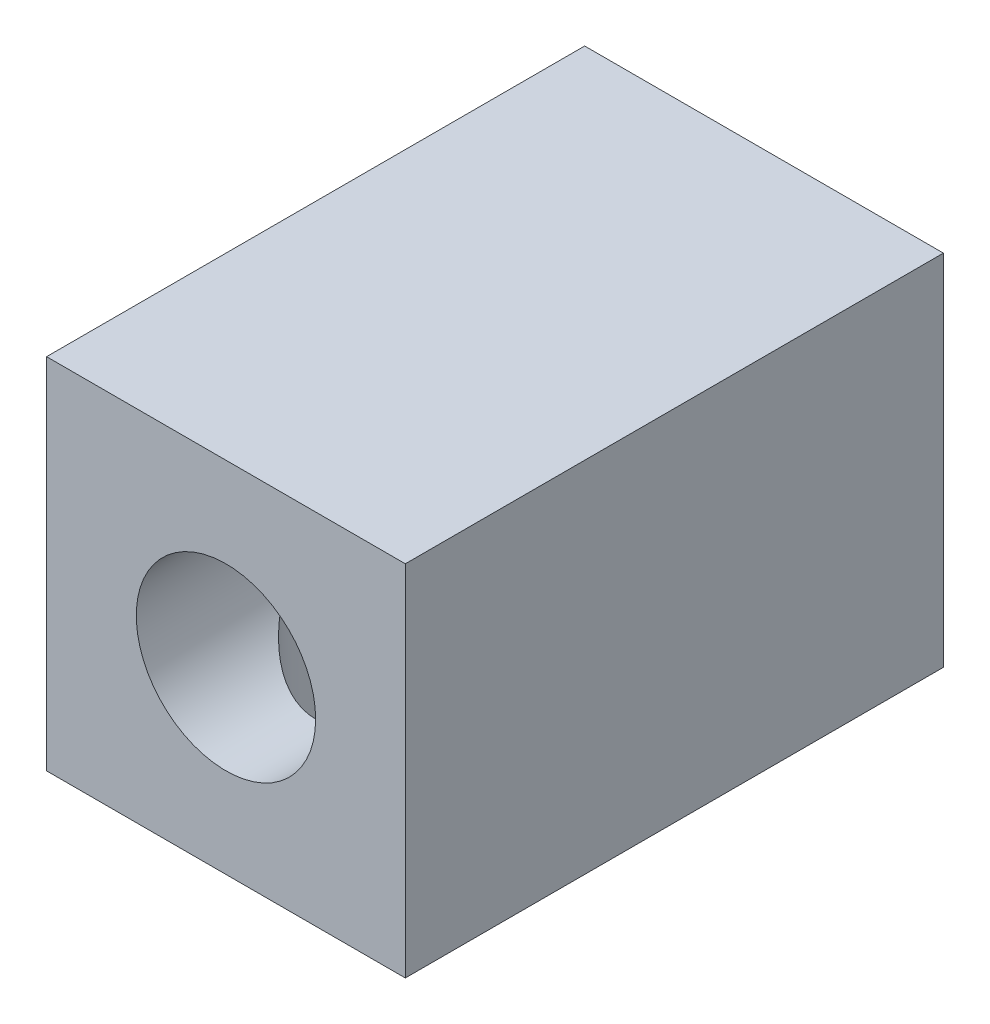
ISO-10303-21;
HEADER;
FILE_DESCRIPTION(('STEP AP214'),'2;1');
FILE_NAME('part.step','',(''),(''),'','','');
FILE_SCHEMA(('AUTOMOTIVE_DESIGN { 1 0 10303 214 1 1 1 1 }'));
ENDSEC;
DATA;
#1=APPLICATION_CONTEXT('core data for automotive mechanical design processes');
#2=APPLICATION_PROTOCOL_DEFINITION('international standard','automotive_design',2000,#1);
#3=PRODUCT_CONTEXT('',#1,'mechanical');
#4=PRODUCT('Part','Part','',(#3));
#5=PRODUCT_RELATED_PRODUCT_CATEGORY('part','',(#4));
#6=PRODUCT_DEFINITION_FORMATION('','',#4);
#7=PRODUCT_DEFINITION_CONTEXT('part definition',#1,'design');
#8=PRODUCT_DEFINITION('design','',#6,#7);
#9=PRODUCT_DEFINITION_SHAPE('','',#8);
#10=(LENGTH_UNIT() NAMED_UNIT(*) SI_UNIT(.MILLI.,.METRE.));
#11=(NAMED_UNIT(*) PLANE_ANGLE_UNIT() SI_UNIT($,.RADIAN.));
#12=(NAMED_UNIT(*) SI_UNIT($,.STERADIAN.) SOLID_ANGLE_UNIT());
#13=UNCERTAINTY_MEASURE_WITH_UNIT(LENGTH_MEASURE(1.E-05),#10,'distance_accuracy_value','');
#14=(GEOMETRIC_REPRESENTATION_CONTEXT(3) GLOBAL_UNCERTAINTY_ASSIGNED_CONTEXT((#13)) GLOBAL_UNIT_ASSIGNED_CONTEXT((#10,
#11,#12)) REPRESENTATION_CONTEXT('',''));
#15=CARTESIAN_POINT('',(0.,0.,0.));
#16=DIRECTION('',(0.,0.,1.));
#17=DIRECTION('',(1.,0.,0.));
#18=AXIS2_PLACEMENT_3D('',#15,#16,#17);
#19=CARTESIAN_POINT('',(-4.99999999999978,-5.00000000000061,14.9999999999998));
#20=DIRECTION('',(0.,0.,-1.));
#21=DIRECTION('',(-0.999999999999998,0.,0.));
#22=AXIS2_PLACEMENT_3D('',#19,#20,#21);
#23=PLANE('',#22);
#24=DIRECTION('',(0.,-0.999999999999998,0.));
#25=VECTOR('',#24,1.);
#26=CARTESIAN_POINT('',(-4.99999999999978,-5.00000000000061,14.9999999999998));
#27=LINE('',#26,#25);
#28=CARTESIAN_POINT('',(-4.99999999999884,4.99999999999967,14.9999999999999));
#29=VERTEX_POINT('',#28);
#30=CARTESIAN_POINT('',(-4.99999999999978,-5.00000000000061,14.9999999999998));
#31=VERTEX_POINT('',#30);
#32=EDGE_CURVE('E91',#29,#31,#27,.T.);
#33=ORIENTED_EDGE('',*,*,#32,.T.);
#34=DIRECTION('',(0.999999999999998,0.,0.));
#35=VECTOR('',#34,1.);
#36=CARTESIAN_POINT('',(-4.99999999999978,-5.00000000000061,14.9999999999998));
#37=LINE('',#36,#35);
#38=CARTESIAN_POINT('',(5.00000000000142,-5.00000000000012,15.0000000000001));
#39=VERTEX_POINT('',#38);
#40=EDGE_CURVE('E93',#31,#39,#37,.T.);
#41=ORIENTED_EDGE('',*,*,#40,.T.);
#42=DIRECTION('',(0.,0.999999999999998,0.));
#43=VECTOR('',#42,1.);
#44=CARTESIAN_POINT('',(5.00000000000142,-5.00000000000012,15.0000000000001));
#45=LINE('',#44,#43);
#46=CARTESIAN_POINT('',(5.00000000000031,5.00000000000006,14.9999999999981));
#47=VERTEX_POINT('',#46);
#48=EDGE_CURVE('E95',#39,#47,#45,.T.);
#49=ORIENTED_EDGE('',*,*,#48,.T.);
#50=DIRECTION('',(-0.999999999999998,0.,0.));
#51=VECTOR('',#50,1.);
#52=CARTESIAN_POINT('',(-4.99999999999884,4.99999999999967,14.9999999999999));
#53=LINE('',#52,#51);
#54=EDGE_CURVE('E36',#47,#29,#53,.T.);
#55=ORIENTED_EDGE('',*,*,#54,.T.);
#56=EDGE_LOOP('',(#33,#41,#49,#55));
#57=FACE_BOUND('',#56,.T.);
#58=CARTESIAN_POINT('',(9.43689570931383E-13,0.,14.9999999999995));
#59=DIRECTION('',(0.,0.,1.));
#60=DIRECTION('',(0.999999999999998,0.,0.));
#61=AXIS2_PLACEMENT_3D('',#58,#59,#60);
#62=CIRCLE('',#61,2.5);
#63=CARTESIAN_POINT('',(2.50000000000094,0.,14.9999999999996));
#64=VERTEX_POINT('',#63);
#65=EDGE_CURVE('E71',#64,#64,#62,.T.);
#66=ORIENTED_EDGE('',*,*,#65,.F.);
#67=EDGE_LOOP('',(#66));
#68=FACE_BOUND('',#67,.T.);
#69=ADVANCED_FACE('F16',(#57,#68),#23,.F.);
#70=CARTESIAN_POINT('',(-4.99999999999823,-5.00000000000023,-4.71844785465692E-13));
#71=DIRECTION('',(0.,0.,-1.));
#72=DIRECTION('',(-0.999999999999998,0.,0.));
#73=AXIS2_PLACEMENT_3D('',#70,#71,#72);
#74=PLANE('',#73);
#75=DIRECTION('',(0.,-0.999999999999998,0.));
#76=VECTOR('',#75,1.);
#77=CARTESIAN_POINT('',(-4.99999999999823,-5.00000000000023,-4.71844785465692E-13));
#78=LINE('',#77,#76);
#79=CARTESIAN_POINT('',(-4.99999999999917,4.99999999999995,-8.60422844084496E-13));
#80=VERTEX_POINT('',#79);
#81=CARTESIAN_POINT('',(-4.99999999999823,-5.00000000000023,-4.71844785465692E-13));
#82=VERTEX_POINT('',#81);
#83=EDGE_CURVE('E78',#80,#82,#78,.T.);
#84=ORIENTED_EDGE('',*,*,#83,.F.);
#85=DIRECTION('',(-0.999999999999998,0.,0.));
#86=VECTOR('',#85,1.);
#87=CARTESIAN_POINT('',(-4.99999999999917,4.99999999999995,-8.60422844084496E-13));
#88=LINE('',#87,#86);
#89=CARTESIAN_POINT('',(4.99999999999998,5.,0.));
#90=VERTEX_POINT('',#89);
#91=EDGE_CURVE('E89',#90,#80,#88,.T.);
#92=ORIENTED_EDGE('',*,*,#91,.F.);
#93=DIRECTION('',(0.,0.999999999999998,0.));
#94=VECTOR('',#93,1.);
#95=CARTESIAN_POINT('',(5.00000000000136,-4.99999999999967,-8.32667268468867E-13));
#96=LINE('',#95,#94);
#97=CARTESIAN_POINT('',(5.00000000000136,-4.99999999999967,-8.32667268468867E-13));
#98=VERTEX_POINT('',#97);
#99=EDGE_CURVE('E87',#98,#90,#96,.T.);
#100=ORIENTED_EDGE('',*,*,#99,.F.);
#101=DIRECTION('',(0.999999999999998,0.,0.));
#102=VECTOR('',#101,1.);
#103=CARTESIAN_POINT('',(-4.99999999999823,-5.00000000000023,-4.71844785465692E-13));
#104=LINE('',#103,#102);
#105=EDGE_CURVE('E85',#82,#98,#104,.T.);
#106=ORIENTED_EDGE('',*,*,#105,.F.);
#107=EDGE_LOOP('',(#84,#92,#100,#106));
#108=FACE_BOUND('',#107,.T.);
#109=CARTESIAN_POINT('',(7.49400541621981E-13,2.77555756156289E-13,-2.77555756156289E-13));
#110=DIRECTION('',(0.,0.,1.));
#111=DIRECTION('',(0.999999999999998,0.,0.));
#112=AXIS2_PLACEMENT_3D('',#109,#110,#111);
#113=CIRCLE('',#112,2.5);
#114=CARTESIAN_POINT('',(2.50000000000075,2.88059506803329E-13,-2.34187669256869E-13));
#115=VERTEX_POINT('',#114);
#116=EDGE_CURVE('E74',#115,#115,#113,.T.);
#117=ORIENTED_EDGE('',*,*,#116,.T.);
#118=EDGE_LOOP('',(#117));
#119=FACE_BOUND('',#118,.T.);
#120=ADVANCED_FACE('F117',(#108,#119),#74,.T.);
#121=CARTESIAN_POINT('',(-4.99999999999978,-5.00000000000061,14.9999999999998));
#122=DIRECTION('',(0.999999999999998,0.,0.));
#123=DIRECTION('',(0.,0.,-1.));
#124=AXIS2_PLACEMENT_3D('',#121,#122,#123);
#125=PLANE('',#124);
#126=ORIENTED_EDGE('',*,*,#83,.T.);
#127=DIRECTION('',(0.,0.,-1.));
#128=VECTOR('',#127,1.);
#129=CARTESIAN_POINT('',(-4.99999999999978,-5.00000000000061,14.9999999999998));
#130=LINE('',#129,#128);
#131=EDGE_CURVE('E62',#31,#82,#130,.T.);
#132=ORIENTED_EDGE('',*,*,#131,.F.);
#133=ORIENTED_EDGE('',*,*,#32,.F.);
#134=DIRECTION('',(0.,0.,-1.));
#135=VECTOR('',#134,1.);
#136=CARTESIAN_POINT('',(-4.99999999999884,4.99999999999967,14.9999999999999));
#137=LINE('',#136,#135);
#138=EDGE_CURVE('E98',#29,#80,#137,.T.);
#139=ORIENTED_EDGE('',*,*,#138,.T.);
#140=EDGE_LOOP('',(#126,#132,#133,#139));
#141=FACE_BOUND('',#140,.T.);
#142=ADVANCED_FACE('F18',(#141),#125,.F.);
#143=CARTESIAN_POINT('',(-4.99999999999978,-5.00000000000061,14.9999999999998));
#144=DIRECTION('',(0.,0.999999999999998,0.));
#145=DIRECTION('',(0.,0.,1.));
#146=AXIS2_PLACEMENT_3D('',#143,#144,#145);
#147=PLANE('',#146);
#148=CARTESIAN_POINT('',(1.52655665885959E-12,-5.00000000000012,9.99999999999979));
#149=DIRECTION('',(0.,0.999999999999998,0.));
#150=DIRECTION('',(0.,0.,1.));
#151=AXIS2_PLACEMENT_3D('',#148,#149,#150);
#152=CIRCLE('',#151,2.5);
#153=CARTESIAN_POINT('',(1.57492074936982E-12,-5.00000000000011,12.4999999999998));
#154=VERTEX_POINT('',#153);
#155=EDGE_CURVE('E76',#154,#154,#152,.T.);
#156=ORIENTED_EDGE('',*,*,#155,.T.);
#157=EDGE_LOOP('',(#156));
#158=FACE_BOUND('',#157,.T.);
#159=ORIENTED_EDGE('',*,*,#105,.T.);
#160=DIRECTION('',(0.,0.,-1.));
#161=VECTOR('',#160,1.);
#162=CARTESIAN_POINT('',(5.00000000000142,-5.00000000000012,15.0000000000001));
#163=LINE('',#162,#161);
#164=EDGE_CURVE('E104',#39,#98,#163,.T.);
#165=ORIENTED_EDGE('',*,*,#164,.F.);
#166=ORIENTED_EDGE('',*,*,#40,.F.);
#167=ORIENTED_EDGE('',*,*,#131,.T.);
#168=EDGE_LOOP('',(#159,#165,#166,#167));
#169=FACE_BOUND('',#168,.T.);
#170=ADVANCED_FACE('F110',(#158,#169),#147,.F.);
#171=CARTESIAN_POINT('',(5.00000000000142,-5.00000000000012,15.0000000000001));
#172=DIRECTION('',(-0.999999999999998,0.,0.));
#173=DIRECTION('',(0.,0.,1.));
#174=AXIS2_PLACEMENT_3D('',#171,#172,#173);
#175=PLANE('',#174);
#176=ORIENTED_EDGE('',*,*,#99,.T.);
#177=DIRECTION('',(0.,0.,-1.));
#178=VECTOR('',#177,1.);
#179=CARTESIAN_POINT('',(5.00000000000031,5.00000000000006,14.9999999999981));
#180=LINE('',#179,#178);
#181=EDGE_CURVE('E101',#47,#90,#180,.T.);
#182=ORIENTED_EDGE('',*,*,#181,.F.);
#183=ORIENTED_EDGE('',*,*,#48,.F.);
#184=ORIENTED_EDGE('',*,*,#164,.T.);
#185=EDGE_LOOP('',(#176,#182,#183,#184));
#186=FACE_BOUND('',#185,.T.);
#187=ADVANCED_FACE('F121',(#186),#175,.F.);
#188=CARTESIAN_POINT('',(-4.99999999999884,4.99999999999967,14.9999999999999));
#189=DIRECTION('',(0.,-0.999999999999998,0.));
#190=DIRECTION('',(0.999999999999998,0.,0.));
#191=AXIS2_PLACEMENT_3D('',#188,#189,#190);
#192=PLANE('',#191);
#193=ORIENTED_EDGE('',*,*,#91,.T.);
#194=ORIENTED_EDGE('',*,*,#138,.F.);
#195=ORIENTED_EDGE('',*,*,#54,.F.);
#196=ORIENTED_EDGE('',*,*,#181,.T.);
#197=EDGE_LOOP('',(#193,#194,#195,#196));
#198=FACE_BOUND('',#197,.T.);
#199=ADVANCED_FACE('F66',(#198),#192,.F.);
#200=CARTESIAN_POINT('',(9.43689570931383E-13,0.,14.9999999999995));
#201=DIRECTION('',(0.,0.,-1.));
#202=DIRECTION('',(-0.999999999999998,0.,0.));
#203=AXIS2_PLACEMENT_3D('',#200,#201,#202);
#204=CYLINDRICAL_SURFACE('',#203,2.5);
#205=CARTESIAN_POINT('',(1.02695629777827E-12,0.,9.99999999999923));
#206=DIRECTION('',(0.,0.707106781186546,-0.707106781186548));
#207=DIRECTION('',(0.,-0.707106781186547,-0.707106781186553));
#208=AXIS2_PLACEMENT_3D('',#205,#206,#207);
#209=ELLIPSE('',#208,3.53553390593274,2.5);
#210=CARTESIAN_POINT('',(2.50000000000206,2.77555756156289E-13,9.99999999999585));
#211=VERTEX_POINT('',#210);
#212=CARTESIAN_POINT('',(-2.49999999999931,0.,9.9999999999997));
#213=VERTEX_POINT('',#212);
#214=EDGE_CURVE('E11',#211,#213,#209,.T.);
#215=ORIENTED_EDGE('',*,*,#214,.F.);
#216=CARTESIAN_POINT('',(1.02695629777827E-12,0.,9.99999999999923));
#217=DIRECTION('',(0.,-0.707106781186547,-0.707106781186553));
#218=DIRECTION('',(0.,0.707106781186546,-0.707106781186548));
#219=AXIS2_PLACEMENT_3D('',#216,#217,#218);
#220=ELLIPSE('',#219,3.53553390593274,2.5);
#221=EDGE_CURVE('E24',#213,#211,#220,.F.);
#222=ORIENTED_EDGE('',*,*,#221,.F.);
#223=EDGE_LOOP('',(#215,#222));
#224=FACE_BOUND('',#223,.T.);
#225=ORIENTED_EDGE('',*,*,#65,.T.);
#226=EDGE_LOOP('',(#225));
#227=FACE_BOUND('',#226,.T.);
#228=ORIENTED_EDGE('',*,*,#116,.F.);
#229=EDGE_LOOP('',(#228));
#230=FACE_BOUND('',#229,.T.);
#231=ADVANCED_FACE('F63',(#224,#227,#230),#204,.F.);
#232=CARTESIAN_POINT('',(1.52655665885959E-12,-5.00000000000012,9.99999999999979));
#233=DIRECTION('',(0.,0.999999999999998,0.));
#234=DIRECTION('',(0.,0.,1.));
#235=AXIS2_PLACEMENT_3D('',#232,#233,#234);
#236=CYLINDRICAL_SURFACE('',#235,2.5);
#237=ORIENTED_EDGE('',*,*,#214,.T.);
#238=ORIENTED_EDGE('',*,*,#221,.T.);
#239=EDGE_LOOP('',(#237,#238));
#240=FACE_BOUND('',#239,.T.);
#241=ORIENTED_EDGE('',*,*,#155,.F.);
#242=EDGE_LOOP('',(#241));
#243=FACE_BOUND('',#242,.T.);
#244=ADVANCED_FACE('F59',(#240,#243),#236,.F.);
#245=CLOSED_SHELL('',(#69,#120,#142,#170,#187,#199,#231,#244));
#246=MANIFOLD_SOLID_BREP('B1',#245);
#247=ADVANCED_BREP_SHAPE_REPRESENTATION('',(#18,#246),#14);
#248=SHAPE_DEFINITION_REPRESENTATION(#9,#247);
ENDSEC;
END-ISO-10303-21;
